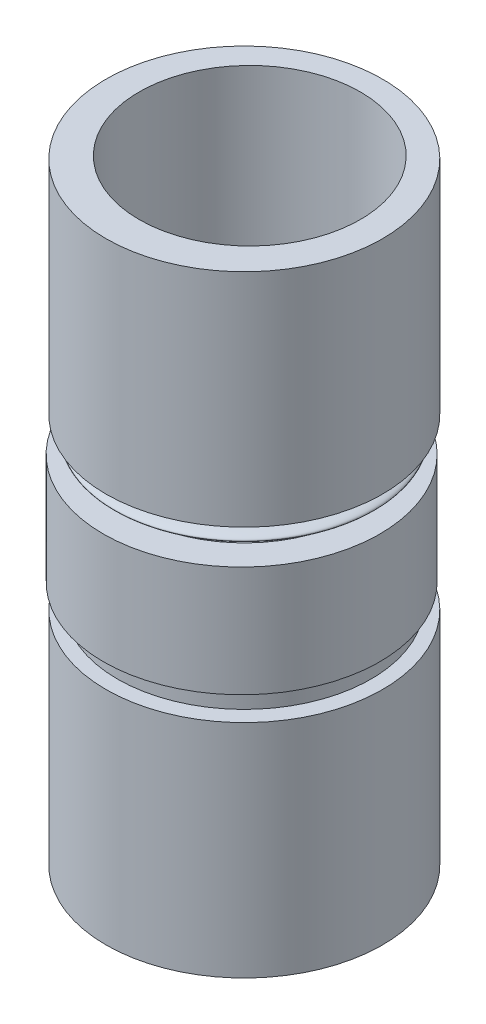
ISO-10303-21;
HEADER;
FILE_DESCRIPTION(('STEP AP214'),'2;1');
FILE_NAME('part.step','',(''),(''),'','','');
FILE_SCHEMA(('AUTOMOTIVE_DESIGN { 1 0 10303 214 1 1 1 1 }'));
ENDSEC;
DATA;
#1=APPLICATION_CONTEXT('core data for automotive mechanical design processes');
#2=APPLICATION_PROTOCOL_DEFINITION('international standard','automotive_design',2000,#1);
#3=PRODUCT_CONTEXT('',#1,'mechanical');
#4=PRODUCT('Part','Part','',(#3));
#5=PRODUCT_RELATED_PRODUCT_CATEGORY('part','',(#4));
#6=PRODUCT_DEFINITION_FORMATION('','',#4);
#7=PRODUCT_DEFINITION_CONTEXT('part definition',#1,'design');
#8=PRODUCT_DEFINITION('design','',#6,#7);
#9=PRODUCT_DEFINITION_SHAPE('','',#8);
#10=(LENGTH_UNIT() NAMED_UNIT(*) SI_UNIT(.MILLI.,.METRE.));
#11=(NAMED_UNIT(*) PLANE_ANGLE_UNIT() SI_UNIT($,.RADIAN.));
#12=(NAMED_UNIT(*) SI_UNIT($,.STERADIAN.) SOLID_ANGLE_UNIT());
#13=UNCERTAINTY_MEASURE_WITH_UNIT(LENGTH_MEASURE(1.E-05),#10,'distance_accuracy_value','');
#14=(GEOMETRIC_REPRESENTATION_CONTEXT(3) GLOBAL_UNCERTAINTY_ASSIGNED_CONTEXT((#13)) GLOBAL_UNIT_ASSIGNED_CONTEXT((#10,
#11,#12)) REPRESENTATION_CONTEXT('',''));
#15=CARTESIAN_POINT('',(0.,0.,0.));
#16=DIRECTION('',(0.,0.,1.));
#17=DIRECTION('',(1.,0.,0.));
#18=AXIS2_PLACEMENT_3D('',#15,#16,#17);
#19=CARTESIAN_POINT('',(0.,27.65,0.));
#20=DIRECTION('',(0.,1.,0.));
#21=DIRECTION('',(0.,0.,1.));
#22=AXIS2_PLACEMENT_3D('',#19,#20,#21);
#23=PLANE('',#22);
#24=CARTESIAN_POINT('',(0.,27.65,0.));
#25=DIRECTION('',(0.,1.,0.));
#26=DIRECTION('',(0.,0.,1.));
#27=AXIS2_PLACEMENT_3D('',#24,#25,#26);
#28=CIRCLE('',#27,6.25);
#29=CARTESIAN_POINT('',(0.,27.65,6.25));
#30=VERTEX_POINT('',#29);
#31=EDGE_CURVE('E11',#30,#30,#28,.T.);
#32=ORIENTED_EDGE('',*,*,#31,.T.);
#33=EDGE_LOOP('',(#32));
#34=FACE_BOUND('',#33,.T.);
#35=CARTESIAN_POINT('',(0.,27.65,-0.247187806085236));
#36=DIRECTION('',(0.,1.,0.));
#37=DIRECTION('',(0.,0.,1.));
#38=AXIS2_PLACEMENT_3D('',#35,#36,#37);
#39=CIRCLE('',#38,5.);
#40=CARTESIAN_POINT('',(0.,27.65,4.75281219391476));
#41=VERTEX_POINT('',#40);
#42=EDGE_CURVE('E54',#41,#41,#39,.T.);
#43=ORIENTED_EDGE('',*,*,#42,.F.);
#44=EDGE_LOOP('',(#43));
#45=FACE_BOUND('',#44,.T.);
#46=ADVANCED_FACE('F43',(#34,#45),#23,.T.);
#47=CARTESIAN_POINT('',(0.,17.65,0.));
#48=DIRECTION('',(0.,1.,0.));
#49=DIRECTION('',(0.,0.,1.));
#50=AXIS2_PLACEMENT_3D('',#47,#48,#49);
#51=PLANE('',#50);
#52=CARTESIAN_POINT('',(0.,17.65,0.));
#53=DIRECTION('',(0.,1.,0.));
#54=DIRECTION('',(0.,0.,1.));
#55=AXIS2_PLACEMENT_3D('',#52,#53,#54);
#56=CIRCLE('',#55,6.25);
#57=CARTESIAN_POINT('',(0.,17.65,6.25));
#58=VERTEX_POINT('',#57);
#59=EDGE_CURVE('E47',#58,#58,#56,.T.);
#60=ORIENTED_EDGE('',*,*,#59,.F.);
#61=EDGE_LOOP('',(#60));
#62=FACE_BOUND('',#61,.T.);
#63=CARTESIAN_POINT('',(0.,17.65,-0.247187806085236));
#64=DIRECTION('',(0.,1.,0.));
#65=DIRECTION('',(0.,0.,1.));
#66=AXIS2_PLACEMENT_3D('',#63,#64,#65);
#67=CIRCLE('',#66,5.);
#68=CARTESIAN_POINT('',(0.,17.65,4.75281219391476));
#69=VERTEX_POINT('',#68);
#70=EDGE_CURVE('E56',#69,#69,#67,.T.);
#71=ORIENTED_EDGE('',*,*,#70,.T.);
#72=EDGE_LOOP('',(#71));
#73=FACE_BOUND('',#72,.T.);
#74=ADVANCED_FACE('F66',(#62,#73),#51,.F.);
#75=CARTESIAN_POINT('',(0.,27.65,0.));
#76=DIRECTION('',(0.,-1.,0.));
#77=DIRECTION('',(0.,0.,-1.));
#78=AXIS2_PLACEMENT_3D('',#75,#76,#77);
#79=CYLINDRICAL_SURFACE('',#78,6.25);
#80=ORIENTED_EDGE('',*,*,#31,.F.);
#81=EDGE_LOOP('',(#80));
#82=FACE_BOUND('',#81,.T.);
#83=ORIENTED_EDGE('',*,*,#59,.T.);
#84=EDGE_LOOP('',(#83));
#85=FACE_BOUND('',#84,.T.);
#86=ADVANCED_FACE('F45',(#82,#85),#79,.T.);
#87=CARTESIAN_POINT('',(0.,27.65,-0.247187806085236));
#88=DIRECTION('',(0.,-1.,0.));
#89=DIRECTION('',(0.,0.,-1.));
#90=AXIS2_PLACEMENT_3D('',#87,#88,#89);
#91=CYLINDRICAL_SURFACE('',#90,5.);
#92=ORIENTED_EDGE('',*,*,#42,.T.);
#93=EDGE_LOOP('',(#92));
#94=FACE_BOUND('',#93,.T.);
#95=ORIENTED_EDGE('',*,*,#70,.F.);
#96=EDGE_LOOP('',(#95));
#97=FACE_BOUND('',#96,.T.);
#98=ADVANCED_FACE('F62',(#94,#97),#91,.F.);
#99=CLOSED_SHELL('',(#46,#74,#86,#98));
#100=MANIFOLD_SOLID_BREP('B2',#99);
#101=CARTESIAN_POINT('',(0.,16.15,0.));
#102=CARTESIAN_POINT('',(11.7577828862584,16.80666319766,0.));
#103=CARTESIAN_POINT('',(0.,17.6644481419128,0.));
#104=B_SPLINE_CURVE_WITH_KNOTS('',2,(#101,#102,#103),.UNSPECIFIED.,.F.,.F.,(3,3),(0.,1.),.UNSPECIFIED.);
#105=CARTESIAN_POINT('',(0.,0.,0.));
#106=DIRECTION('',(0.,-1.,0.));
#107=AXIS1_PLACEMENT('',#105,#106);
#108=SURFACE_OF_REVOLUTION('',#104,#107);
#109=CARTESIAN_POINT('',(0.,17.6644481419128,0.));
#110=VERTEX_POINT('',#109);
#111=VERTEX_LOOP('',#110);
#112=FACE_BOUND('',#111,.T.);
#113=CARTESIAN_POINT('',(0.,16.15,0.));
#114=VERTEX_POINT('',#113);
#115=VERTEX_LOOP('',#114);
#116=FACE_BOUND('',#115,.T.);
#117=ADVANCED_FACE('F113',(#112,#116),#108,.F.);
#118=CLOSED_SHELL('',(#117));
#119=MANIFOLD_SOLID_BREP('B6',#118);
#120=CARTESIAN_POINT('',(0.,16.15,0.121569804986343));
#121=DIRECTION('',(0.,1.,0.));
#122=DIRECTION('',(0.,0.,1.));
#123=AXIS2_PLACEMENT_3D('',#120,#121,#122);
#124=PLANE('',#123);
#125=CARTESIAN_POINT('',(0.,16.15,0.121569804986343));
#126=DIRECTION('',(0.,1.,0.));
#127=DIRECTION('',(0.,0.,1.));
#128=AXIS2_PLACEMENT_3D('',#125,#126,#127);
#129=CIRCLE('',#128,6.25);
#130=CARTESIAN_POINT('',(0.,16.15,6.37156980498634));
#131=VERTEX_POINT('',#130);
#132=EDGE_CURVE('E112',#131,#131,#129,.T.);
#133=ORIENTED_EDGE('',*,*,#132,.T.);
#134=EDGE_LOOP('',(#133));
#135=FACE_BOUND('',#134,.T.);
#136=CARTESIAN_POINT('',(0.,16.15,0.));
#137=DIRECTION('',(0.,1.,0.));
#138=DIRECTION('',(0.,0.,1.));
#139=AXIS2_PLACEMENT_3D('',#136,#137,#138);
#140=CIRCLE('',#139,5.);
#141=CARTESIAN_POINT('',(0.,16.15,5.));
#142=VERTEX_POINT('',#141);
#143=EDGE_CURVE('E157',#142,#142,#140,.T.);
#144=ORIENTED_EDGE('',*,*,#143,.F.);
#145=EDGE_LOOP('',(#144));
#146=FACE_BOUND('',#145,.T.);
#147=ADVANCED_FACE('F146',(#135,#146),#124,.T.);
#148=CARTESIAN_POINT('',(0.,11.15,0.121569804986343));
#149=DIRECTION('',(0.,1.,0.));
#150=DIRECTION('',(0.,0.,1.));
#151=AXIS2_PLACEMENT_3D('',#148,#149,#150);
#152=PLANE('',#151);
#153=CARTESIAN_POINT('',(0.,11.15,0.121569804986343));
#154=DIRECTION('',(0.,1.,0.));
#155=DIRECTION('',(0.,0.,1.));
#156=AXIS2_PLACEMENT_3D('',#153,#154,#155);
#157=CIRCLE('',#156,6.25);
#158=CARTESIAN_POINT('',(0.,11.15,6.37156980498634));
#159=VERTEX_POINT('',#158);
#160=EDGE_CURVE('E150',#159,#159,#157,.T.);
#161=ORIENTED_EDGE('',*,*,#160,.F.);
#162=EDGE_LOOP('',(#161));
#163=FACE_BOUND('',#162,.T.);
#164=CARTESIAN_POINT('',(0.,11.15,0.));
#165=DIRECTION('',(0.,1.,0.));
#166=DIRECTION('',(0.,0.,1.));
#167=AXIS2_PLACEMENT_3D('',#164,#165,#166);
#168=CIRCLE('',#167,5.);
#169=CARTESIAN_POINT('',(0.,11.15,5.));
#170=VERTEX_POINT('',#169);
#171=EDGE_CURVE('E159',#170,#170,#168,.T.);
#172=ORIENTED_EDGE('',*,*,#171,.T.);
#173=EDGE_LOOP('',(#172));
#174=FACE_BOUND('',#173,.T.);
#175=ADVANCED_FACE('F169',(#163,#174),#152,.F.);
#176=CARTESIAN_POINT('',(0.,16.15,0.121569804986343));
#177=DIRECTION('',(0.,-1.,0.));
#178=DIRECTION('',(0.,0.,-1.));
#179=AXIS2_PLACEMENT_3D('',#176,#177,#178);
#180=CYLINDRICAL_SURFACE('',#179,6.25);
#181=ORIENTED_EDGE('',*,*,#132,.F.);
#182=EDGE_LOOP('',(#181));
#183=FACE_BOUND('',#182,.T.);
#184=ORIENTED_EDGE('',*,*,#160,.T.);
#185=EDGE_LOOP('',(#184));
#186=FACE_BOUND('',#185,.T.);
#187=ADVANCED_FACE('F148',(#183,#186),#180,.T.);
#188=CARTESIAN_POINT('',(0.,16.15,0.));
#189=DIRECTION('',(0.,-1.,0.));
#190=DIRECTION('',(0.,0.,-1.));
#191=AXIS2_PLACEMENT_3D('',#188,#189,#190);
#192=CYLINDRICAL_SURFACE('',#191,5.);
#193=ORIENTED_EDGE('',*,*,#143,.T.);
#194=EDGE_LOOP('',(#193));
#195=FACE_BOUND('',#194,.T.);
#196=ORIENTED_EDGE('',*,*,#171,.F.);
#197=EDGE_LOOP('',(#196));
#198=FACE_BOUND('',#197,.T.);
#199=ADVANCED_FACE('F165',(#195,#198),#192,.F.);
#200=CLOSED_SHELL('',(#147,#175,#187,#199));
#201=MANIFOLD_SOLID_BREP('B36',#200);
#202=CARTESIAN_POINT('',(0.,10.9,0.));
#203=DIRECTION('',(0.,-1.,0.));
#204=DIRECTION('',(0.,0.,-1.));
#205=AXIS2_PLACEMENT_3D('',#202,#203,#204);
#206=CYLINDRICAL_SURFACE('',#205,5.73162283341191);
#207=CARTESIAN_POINT('',(0.,10.9,0.));
#208=DIRECTION('',(0.,1.,0.));
#209=DIRECTION('',(0.,0.,1.));
#210=AXIS2_PLACEMENT_3D('',#207,#208,#209);
#211=CIRCLE('',#210,5.73162283341191);
#212=CARTESIAN_POINT('',(0.,10.9,5.73162283341191));
#213=VERTEX_POINT('',#212);
#214=EDGE_CURVE('E145',#213,#213,#211,.T.);
#215=ORIENTED_EDGE('',*,*,#214,.F.);
#216=EDGE_LOOP('',(#215));
#217=FACE_BOUND('',#216,.T.);
#218=CARTESIAN_POINT('',(0.,10.15,0.));
#219=DIRECTION('',(0.,1.,0.));
#220=DIRECTION('',(0.,0.,1.));
#221=AXIS2_PLACEMENT_3D('',#218,#219,#220);
#222=CIRCLE('',#221,5.73162283341191);
#223=CARTESIAN_POINT('',(0.,10.15,5.73162283341191));
#224=VERTEX_POINT('',#223);
#225=EDGE_CURVE('E218',#224,#224,#222,.T.);
#226=ORIENTED_EDGE('',*,*,#225,.T.);
#227=EDGE_LOOP('',(#226));
#228=FACE_BOUND('',#227,.T.);
#229=ADVANCED_FACE('F215',(#217,#228),#206,.T.);
#230=CARTESIAN_POINT('',(0.,10.9,0.));
#231=DIRECTION('',(0.,1.,0.));
#232=DIRECTION('',(0.,0.,1.));
#233=AXIS2_PLACEMENT_3D('',#230,#231,#232);
#234=PLANE('',#233);
#235=ORIENTED_EDGE('',*,*,#214,.T.);
#236=EDGE_LOOP('',(#235));
#237=FACE_BOUND('',#236,.T.);
#238=ADVANCED_FACE('F230',(#237),#234,.T.);
#239=CARTESIAN_POINT('',(0.,10.15,0.));
#240=DIRECTION('',(0.,1.,0.));
#241=DIRECTION('',(0.,0.,1.));
#242=AXIS2_PLACEMENT_3D('',#239,#240,#241);
#243=PLANE('',#242);
#244=ORIENTED_EDGE('',*,*,#225,.F.);
#245=EDGE_LOOP('',(#244));
#246=FACE_BOUND('',#245,.T.);
#247=ADVANCED_FACE('F228',(#246),#243,.F.);
#248=CLOSED_SHELL('',(#229,#238,#247));
#249=MANIFOLD_SOLID_BREP('B107',#248);
#250=CARTESIAN_POINT('',(0.,10.,0.));
#251=DIRECTION('',(0.,1.,0.));
#252=DIRECTION('',(0.,0.,1.));
#253=AXIS2_PLACEMENT_3D('',#250,#251,#252);
#254=PLANE('',#253);
#255=CARTESIAN_POINT('',(0.,10.,0.));
#256=DIRECTION('',(0.,1.,0.));
#257=DIRECTION('',(0.,0.,1.));
#258=AXIS2_PLACEMENT_3D('',#255,#256,#257);
#259=CIRCLE('',#258,6.25);
#260=CARTESIAN_POINT('',(0.,10.,6.25));
#261=VERTEX_POINT('',#260);
#262=EDGE_CURVE('E214',#261,#261,#259,.T.);
#263=ORIENTED_EDGE('',*,*,#262,.T.);
#264=EDGE_LOOP('',(#263));
#265=FACE_BOUND('',#264,.T.);
#266=CARTESIAN_POINT('',(0.,10.,0.));
#267=DIRECTION('',(0.,1.,0.));
#268=DIRECTION('',(0.,0.,1.));
#269=AXIS2_PLACEMENT_3D('',#266,#267,#268);
#270=CIRCLE('',#269,5.);
#271=CARTESIAN_POINT('',(0.,10.,5.));
#272=VERTEX_POINT('',#271);
#273=EDGE_CURVE('E267',#272,#272,#270,.T.);
#274=ORIENTED_EDGE('',*,*,#273,.F.);
#275=EDGE_LOOP('',(#274));
#276=FACE_BOUND('',#275,.T.);
#277=ADVANCED_FACE('F256',(#265,#276),#254,.T.);
#278=CARTESIAN_POINT('',(0.,0.,0.));
#279=DIRECTION('',(0.,1.,0.));
#280=DIRECTION('',(0.,0.,1.));
#281=AXIS2_PLACEMENT_3D('',#278,#279,#280);
#282=PLANE('',#281);
#283=CARTESIAN_POINT('',(0.,0.,0.));
#284=DIRECTION('',(0.,1.,0.));
#285=DIRECTION('',(0.,0.,1.));
#286=AXIS2_PLACEMENT_3D('',#283,#284,#285);
#287=CIRCLE('',#286,6.25);
#288=CARTESIAN_POINT('',(0.,0.,6.25));
#289=VERTEX_POINT('',#288);
#290=EDGE_CURVE('E260',#289,#289,#287,.T.);
#291=ORIENTED_EDGE('',*,*,#290,.F.);
#292=EDGE_LOOP('',(#291));
#293=FACE_BOUND('',#292,.T.);
#294=CARTESIAN_POINT('',(0.,0.,0.));
#295=DIRECTION('',(0.,1.,0.));
#296=DIRECTION('',(0.,0.,1.));
#297=AXIS2_PLACEMENT_3D('',#294,#295,#296);
#298=CIRCLE('',#297,5.);
#299=CARTESIAN_POINT('',(0.,0.,5.));
#300=VERTEX_POINT('',#299);
#301=EDGE_CURVE('E269',#300,#300,#298,.T.);
#302=ORIENTED_EDGE('',*,*,#301,.T.);
#303=EDGE_LOOP('',(#302));
#304=FACE_BOUND('',#303,.T.);
#305=ADVANCED_FACE('F279',(#293,#304),#282,.F.);
#306=CARTESIAN_POINT('',(0.,10.,0.));
#307=DIRECTION('',(0.,-1.,0.));
#308=DIRECTION('',(0.,0.,-1.));
#309=AXIS2_PLACEMENT_3D('',#306,#307,#308);
#310=CYLINDRICAL_SURFACE('',#309,6.25);
#311=ORIENTED_EDGE('',*,*,#262,.F.);
#312=EDGE_LOOP('',(#311));
#313=FACE_BOUND('',#312,.T.);
#314=ORIENTED_EDGE('',*,*,#290,.T.);
#315=EDGE_LOOP('',(#314));
#316=FACE_BOUND('',#315,.T.);
#317=ADVANCED_FACE('F258',(#313,#316),#310,.T.);
#318=CARTESIAN_POINT('',(0.,10.,0.));
#319=DIRECTION('',(0.,-1.,0.));
#320=DIRECTION('',(0.,0.,-1.));
#321=AXIS2_PLACEMENT_3D('',#318,#319,#320);
#322=CYLINDRICAL_SURFACE('',#321,5.);
#323=ORIENTED_EDGE('',*,*,#273,.T.);
#324=EDGE_LOOP('',(#323));
#325=FACE_BOUND('',#324,.T.);
#326=ORIENTED_EDGE('',*,*,#301,.F.);
#327=EDGE_LOOP('',(#326));
#328=FACE_BOUND('',#327,.T.);
#329=ADVANCED_FACE('F275',(#325,#328),#322,.F.);
#330=CLOSED_SHELL('',(#277,#305,#317,#329));
#331=MANIFOLD_SOLID_BREP('B140',#330);
#332=ADVANCED_BREP_SHAPE_REPRESENTATION('',(#18,#100,#119,#201,#249,#331),#14);
#333=SHAPE_DEFINITION_REPRESENTATION(#9,#332);
ENDSEC;
END-ISO-10303-21;
